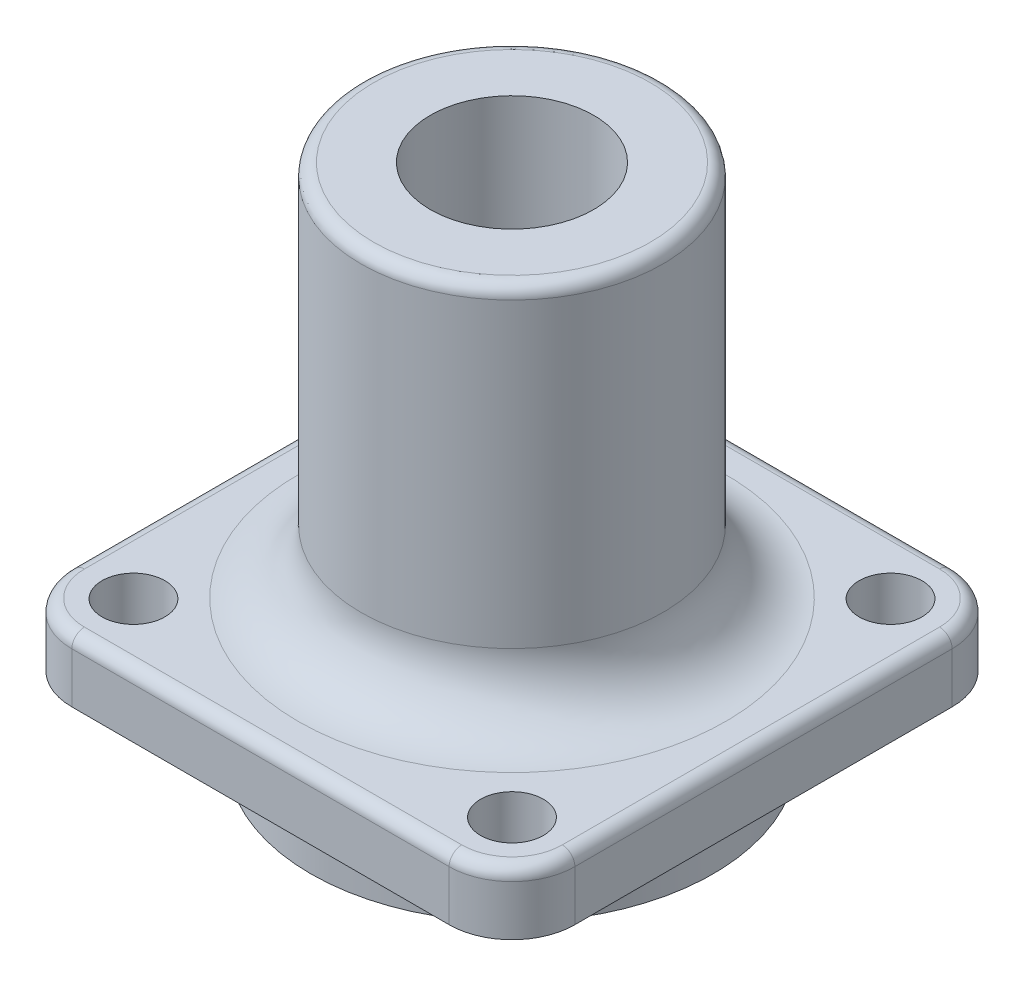
ISO-10303-21;
HEADER;
FILE_DESCRIPTION(('STEP AP214'),'2;1');
FILE_NAME('part.step','',(''),(''),'','','');
FILE_SCHEMA(('AUTOMOTIVE_DESIGN { 1 0 10303 214 1 1 1 1 }'));
ENDSEC;
DATA;
#1=APPLICATION_CONTEXT('core data for automotive mechanical design processes');
#2=APPLICATION_PROTOCOL_DEFINITION('international standard','automotive_design',2000,#1);
#3=PRODUCT_CONTEXT('',#1,'mechanical');
#4=PRODUCT('Part','Part','',(#3));
#5=PRODUCT_RELATED_PRODUCT_CATEGORY('part','',(#4));
#6=PRODUCT_DEFINITION_FORMATION('','',#4);
#7=PRODUCT_DEFINITION_CONTEXT('part definition',#1,'design');
#8=PRODUCT_DEFINITION('design','',#6,#7);
#9=PRODUCT_DEFINITION_SHAPE('','',#8);
#10=(LENGTH_UNIT() NAMED_UNIT(*) SI_UNIT(.MILLI.,.METRE.));
#11=(NAMED_UNIT(*) PLANE_ANGLE_UNIT() SI_UNIT($,.RADIAN.));
#12=(NAMED_UNIT(*) SI_UNIT($,.STERADIAN.) SOLID_ANGLE_UNIT());
#13=UNCERTAINTY_MEASURE_WITH_UNIT(LENGTH_MEASURE(1.E-05),#10,'distance_accuracy_value','');
#14=(GEOMETRIC_REPRESENTATION_CONTEXT(3) GLOBAL_UNCERTAINTY_ASSIGNED_CONTEXT((#13)) GLOBAL_UNIT_ASSIGNED_CONTEXT((#10,
#11,#12)) REPRESENTATION_CONTEXT('',''));
#15=CARTESIAN_POINT('',(0.,0.,0.));
#16=DIRECTION('',(0.,0.,1.));
#17=DIRECTION('',(1.,0.,0.));
#18=AXIS2_PLACEMENT_3D('',#15,#16,#17);
#19=CARTESIAN_POINT('',(0.,5.,0.));
#20=DIRECTION('',(0.,1.,0.));
#21=DIRECTION('',(0.,0.,1.));
#22=AXIS2_PLACEMENT_3D('',#19,#20,#21);
#23=PLANE('',#22);
#24=CARTESIAN_POINT('',(0.,5.,0.));
#25=DIRECTION('',(0.,1.,0.));
#26=DIRECTION('',(0.,0.,1.));
#27=AXIS2_PLACEMENT_3D('',#24,#25,#26);
#28=CIRCLE('',#27,17.);
#29=CARTESIAN_POINT('',(0.,5.,17.));
#30=VERTEX_POINT('',#29);
#31=EDGE_CURVE('E348',#30,#30,#28,.F.);
#32=ORIENTED_EDGE('',*,*,#31,.T.);
#33=EDGE_LOOP('',(#32));
#34=FACE_BOUND('',#33,.T.);
#35=CARTESIAN_POINT('',(-15.,5.,15.1028020210667));
#36=DIRECTION('',(0.,1.,0.));
#37=DIRECTION('',(0.,0.,1.));
#38=AXIS2_PLACEMENT_3D('',#35,#36,#37);
#39=CIRCLE('',#38,2.5);
#40=CARTESIAN_POINT('',(-15.,5.,17.6028020210667));
#41=VERTEX_POINT('',#40);
#42=EDGE_CURVE('E417',#41,#41,#39,.T.);
#43=ORIENTED_EDGE('',*,*,#42,.F.);
#44=EDGE_LOOP('',(#43));
#45=FACE_BOUND('',#44,.T.);
#46=CARTESIAN_POINT('',(15.1028020210667,5.,15.1028020210667));
#47=DIRECTION('',(0.,1.,0.));
#48=DIRECTION('',(0.,0.,1.));
#49=AXIS2_PLACEMENT_3D('',#46,#47,#48);
#50=CIRCLE('',#49,2.5);
#51=CARTESIAN_POINT('',(15.1028020210667,5.,17.6028020210667));
#52=VERTEX_POINT('',#51);
#53=EDGE_CURVE('E423',#52,#52,#50,.T.);
#54=ORIENTED_EDGE('',*,*,#53,.F.);
#55=EDGE_LOOP('',(#54));
#56=FACE_BOUND('',#55,.T.);
#57=CARTESIAN_POINT('',(15.1028020210667,5.,-15.));
#58=DIRECTION('',(0.,1.,0.));
#59=DIRECTION('',(0.,0.,1.));
#60=AXIS2_PLACEMENT_3D('',#57,#58,#59);
#61=CIRCLE('',#60,2.5);
#62=CARTESIAN_POINT('',(15.1028020210667,5.,-12.5));
#63=VERTEX_POINT('',#62);
#64=EDGE_CURVE('E460',#63,#63,#61,.T.);
#65=ORIENTED_EDGE('',*,*,#64,.F.);
#66=EDGE_LOOP('',(#65));
#67=FACE_BOUND('',#66,.T.);
#68=CARTESIAN_POINT('',(-15.,5.,-15.));
#69=DIRECTION('',(0.,1.,0.));
#70=DIRECTION('',(0.,0.,1.));
#71=AXIS2_PLACEMENT_3D('',#68,#69,#70);
#72=CIRCLE('',#71,2.5);
#73=CARTESIAN_POINT('',(-15.,5.,-12.5));
#74=VERTEX_POINT('',#73);
#75=EDGE_CURVE('E159',#74,#74,#72,.T.);
#76=ORIENTED_EDGE('',*,*,#75,.F.);
#77=EDGE_LOOP('',(#76));
#78=FACE_BOUND('',#77,.T.);
#79=CARTESIAN_POINT('',(15.,5.,-15.));
#80=DIRECTION('',(0.,1.,0.));
#81=DIRECTION('',(0.,0.,1.));
#82=AXIS2_PLACEMENT_3D('',#79,#80,#81);
#83=CIRCLE('',#82,4.);
#84=CARTESIAN_POINT('',(15.,5.,-19.));
#85=VERTEX_POINT('',#84);
#86=CARTESIAN_POINT('',(19.,5.,-15.));
#87=VERTEX_POINT('',#86);
#88=EDGE_CURVE('E147',#85,#87,#83,.F.);
#89=ORIENTED_EDGE('',*,*,#88,.F.);
#90=DIRECTION('',(1.,0.,0.));
#91=VECTOR('',#90,1.);
#92=CARTESIAN_POINT('',(0.,5.,-19.));
#93=LINE('',#92,#91);
#94=CARTESIAN_POINT('',(-15.,5.,-19.));
#95=VERTEX_POINT('',#94);
#96=EDGE_CURVE('E141',#85,#95,#93,.F.);
#97=ORIENTED_EDGE('',*,*,#96,.T.);
#98=CARTESIAN_POINT('',(-15.,5.,-15.));
#99=DIRECTION('',(0.,1.,0.));
#100=DIRECTION('',(0.,0.,1.));
#101=AXIS2_PLACEMENT_3D('',#98,#99,#100);
#102=CIRCLE('',#101,4.);
#103=CARTESIAN_POINT('',(-19.,5.,-15.));
#104=VERTEX_POINT('',#103);
#105=EDGE_CURVE('E136',#104,#95,#102,.F.);
#106=ORIENTED_EDGE('',*,*,#105,.F.);
#107=DIRECTION('',(0.,0.,1.));
#108=VECTOR('',#107,1.);
#109=CARTESIAN_POINT('',(-19.,5.,20.));
#110=LINE('',#109,#108);
#111=CARTESIAN_POINT('',(-19.,5.,15.));
#112=VERTEX_POINT('',#111);
#113=EDGE_CURVE('E139',#104,#112,#110,.T.);
#114=ORIENTED_EDGE('',*,*,#113,.T.);
#115=CARTESIAN_POINT('',(-15.,5.,15.));
#116=DIRECTION('',(0.,1.,0.));
#117=DIRECTION('',(0.,0.,1.));
#118=AXIS2_PLACEMENT_3D('',#115,#116,#117);
#119=CIRCLE('',#118,4.);
#120=CARTESIAN_POINT('',(-15.,5.,19.));
#121=VERTEX_POINT('',#120);
#122=EDGE_CURVE('E351',#121,#112,#119,.F.);
#123=ORIENTED_EDGE('',*,*,#122,.F.);
#124=DIRECTION('',(1.,0.,0.));
#125=VECTOR('',#124,1.);
#126=CARTESIAN_POINT('',(20.,5.,19.));
#127=LINE('',#126,#125);
#128=CARTESIAN_POINT('',(15.,5.,19.));
#129=VERTEX_POINT('',#128);
#130=EDGE_CURVE('E386',#121,#129,#127,.T.);
#131=ORIENTED_EDGE('',*,*,#130,.T.);
#132=CARTESIAN_POINT('',(15.,5.,15.));
#133=DIRECTION('',(0.,1.,0.));
#134=DIRECTION('',(0.,0.,1.));
#135=AXIS2_PLACEMENT_3D('',#132,#133,#134);
#136=CIRCLE('',#135,4.);
#137=CARTESIAN_POINT('',(19.,5.,15.));
#138=VERTEX_POINT('',#137);
#139=EDGE_CURVE('E148',#138,#129,#136,.F.);
#140=ORIENTED_EDGE('',*,*,#139,.F.);
#141=DIRECTION('',(0.,0.,1.));
#142=VECTOR('',#141,1.);
#143=CARTESIAN_POINT('',(19.,5.,0.));
#144=LINE('',#143,#142);
#145=EDGE_CURVE('E401',#138,#87,#144,.F.);
#146=ORIENTED_EDGE('',*,*,#145,.T.);
#147=EDGE_LOOP('',(#89,#97,#106,#114,#123,#131,#140,#146));
#148=FACE_BOUND('',#147,.T.);
#149=ADVANCED_FACE('F43',(#34,#45,#56,#67,#78,#148),#23,.T.);
#150=CARTESIAN_POINT('',(20.,5.,0.));
#151=DIRECTION('',(1.,0.,0.));
#152=DIRECTION('',(0.,0.,-1.));
#153=AXIS2_PLACEMENT_3D('',#150,#151,#152);
#154=PLANE('',#153);
#155=DIRECTION('',(0.,0.,1.));
#156=VECTOR('',#155,1.);
#157=CARTESIAN_POINT('',(20.,4.,0.));
#158=LINE('',#157,#156);
#159=CARTESIAN_POINT('',(20.,4.,-15.));
#160=VERTEX_POINT('',#159);
#161=CARTESIAN_POINT('',(20.,4.,15.));
#162=VERTEX_POINT('',#161);
#163=EDGE_CURVE('E392',#160,#162,#158,.T.);
#164=ORIENTED_EDGE('',*,*,#163,.T.);
#165=DIRECTION('',(0.,-1.,0.));
#166=VECTOR('',#165,1.);
#167=CARTESIAN_POINT('',(20.,0.,15.));
#168=LINE('',#167,#166);
#169=CARTESIAN_POINT('',(20.,0.,15.));
#170=VERTEX_POINT('',#169);
#171=EDGE_CURVE('E201',#162,#170,#168,.T.);
#172=ORIENTED_EDGE('',*,*,#171,.T.);
#173=DIRECTION('',(0.,0.,1.));
#174=VECTOR('',#173,1.);
#175=CARTESIAN_POINT('',(20.,0.,0.));
#176=LINE('',#175,#174);
#177=CARTESIAN_POINT('',(20.,0.,-15.));
#178=VERTEX_POINT('',#177);
#179=EDGE_CURVE('E415',#178,#170,#176,.T.);
#180=ORIENTED_EDGE('',*,*,#179,.F.);
#181=DIRECTION('',(0.,-1.,0.));
#182=VECTOR('',#181,1.);
#183=CARTESIAN_POINT('',(20.,5.,-15.));
#184=LINE('',#183,#182);
#185=EDGE_CURVE('E198',#178,#160,#184,.F.);
#186=ORIENTED_EDGE('',*,*,#185,.T.);
#187=EDGE_LOOP('',(#164,#172,#180,#186));
#188=FACE_BOUND('',#187,.T.);
#189=ADVANCED_FACE('F262',(#188),#154,.T.);
#190=CARTESIAN_POINT('',(0.,5.,-20.));
#191=DIRECTION('',(0.,0.,-1.));
#192=DIRECTION('',(-1.,0.,0.));
#193=AXIS2_PLACEMENT_3D('',#190,#191,#192);
#194=PLANE('',#193);
#195=DIRECTION('',(1.,0.,0.));
#196=VECTOR('',#195,1.);
#197=CARTESIAN_POINT('',(0.,0.,-20.));
#198=LINE('',#197,#196);
#199=CARTESIAN_POINT('',(-15.,0.,-20.));
#200=VERTEX_POINT('',#199);
#201=CARTESIAN_POINT('',(15.,0.,-20.));
#202=VERTEX_POINT('',#201);
#203=EDGE_CURVE('E426',#200,#202,#198,.T.);
#204=ORIENTED_EDGE('',*,*,#203,.F.);
#205=DIRECTION('',(0.,-1.,0.));
#206=VECTOR('',#205,1.);
#207=CARTESIAN_POINT('',(-15.,4.,-20.));
#208=LINE('',#207,#206);
#209=CARTESIAN_POINT('',(-15.,4.,-20.));
#210=VERTEX_POINT('',#209);
#211=EDGE_CURVE('E206',#200,#210,#208,.F.);
#212=ORIENTED_EDGE('',*,*,#211,.T.);
#213=DIRECTION('',(1.,0.,0.));
#214=VECTOR('',#213,1.);
#215=CARTESIAN_POINT('',(0.,4.,-20.));
#216=LINE('',#215,#214);
#217=CARTESIAN_POINT('',(15.,4.,-20.));
#218=VERTEX_POINT('',#217);
#219=EDGE_CURVE('E357',#210,#218,#216,.T.);
#220=ORIENTED_EDGE('',*,*,#219,.T.);
#221=DIRECTION('',(0.,-1.,0.));
#222=VECTOR('',#221,1.);
#223=CARTESIAN_POINT('',(15.,5.,-20.));
#224=LINE('',#223,#222);
#225=EDGE_CURVE('E60',#218,#202,#224,.T.);
#226=ORIENTED_EDGE('',*,*,#225,.T.);
#227=EDGE_LOOP('',(#204,#212,#220,#226));
#228=FACE_BOUND('',#227,.T.);
#229=ADVANCED_FACE('F268',(#228),#194,.T.);
#230=CARTESIAN_POINT('',(-20.,5.,0.));
#231=DIRECTION('',(1.,0.,0.));
#232=DIRECTION('',(0.,0.,-1.));
#233=AXIS2_PLACEMENT_3D('',#230,#231,#232);
#234=PLANE('',#233);
#235=DIRECTION('',(0.,0.,1.));
#236=VECTOR('',#235,1.);
#237=CARTESIAN_POINT('',(-20.,0.,0.));
#238=LINE('',#237,#236);
#239=CARTESIAN_POINT('',(-20.,0.,-15.));
#240=VERTEX_POINT('',#239);
#241=CARTESIAN_POINT('',(-20.,0.,15.));
#242=VERTEX_POINT('',#241);
#243=EDGE_CURVE('E418',#240,#242,#238,.T.);
#244=ORIENTED_EDGE('',*,*,#243,.T.);
#245=DIRECTION('',(0.,-1.,0.));
#246=VECTOR('',#245,1.);
#247=CARTESIAN_POINT('',(-20.,5.,15.));
#248=LINE('',#247,#246);
#249=CARTESIAN_POINT('',(-20.,4.,15.));
#250=VERTEX_POINT('',#249);
#251=EDGE_CURVE('E195',#242,#250,#248,.F.);
#252=ORIENTED_EDGE('',*,*,#251,.T.);
#253=DIRECTION('',(0.,0.,1.));
#254=VECTOR('',#253,1.);
#255=CARTESIAN_POINT('',(-20.,4.,-20.));
#256=LINE('',#255,#254);
#257=CARTESIAN_POINT('',(-20.,4.,-15.));
#258=VERTEX_POINT('',#257);
#259=EDGE_CURVE('E352',#250,#258,#256,.F.);
#260=ORIENTED_EDGE('',*,*,#259,.T.);
#261=DIRECTION('',(0.,-1.,0.));
#262=VECTOR('',#261,1.);
#263=CARTESIAN_POINT('',(-20.,0.,-15.));
#264=LINE('',#263,#262);
#265=EDGE_CURVE('E192',#258,#240,#264,.T.);
#266=ORIENTED_EDGE('',*,*,#265,.T.);
#267=EDGE_LOOP('',(#244,#252,#260,#266));
#268=FACE_BOUND('',#267,.T.);
#269=ADVANCED_FACE('F282',(#268),#234,.F.);
#270=CARTESIAN_POINT('',(-15.,5.,-15.));
#271=DIRECTION('',(0.,-1.,0.));
#272=DIRECTION('',(0.,0.,-1.));
#273=AXIS2_PLACEMENT_3D('',#270,#271,#272);
#274=CYLINDRICAL_SURFACE('',#273,2.5);
#275=ORIENTED_EDGE('',*,*,#75,.T.);
#276=EDGE_LOOP('',(#275));
#277=FACE_BOUND('',#276,.T.);
#278=CARTESIAN_POINT('',(-15.,0.,-15.));
#279=DIRECTION('',(0.,1.,0.));
#280=DIRECTION('',(0.,0.,1.));
#281=AXIS2_PLACEMENT_3D('',#278,#279,#280);
#282=CIRCLE('',#281,2.5);
#283=CARTESIAN_POINT('',(-15.,0.,-12.5));
#284=VERTEX_POINT('',#283);
#285=EDGE_CURVE('E439',#284,#284,#282,.T.);
#286=ORIENTED_EDGE('',*,*,#285,.F.);
#287=EDGE_LOOP('',(#286));
#288=FACE_BOUND('',#287,.T.);
#289=ADVANCED_FACE('F285',(#277,#288),#274,.F.);
#290=CARTESIAN_POINT('',(15.1028020210667,5.,-15.));
#291=DIRECTION('',(0.,-1.,0.));
#292=DIRECTION('',(0.,0.,-1.));
#293=AXIS2_PLACEMENT_3D('',#290,#291,#292);
#294=CYLINDRICAL_SURFACE('',#293,2.5);
#295=ORIENTED_EDGE('',*,*,#64,.T.);
#296=EDGE_LOOP('',(#295));
#297=FACE_BOUND('',#296,.T.);
#298=CARTESIAN_POINT('',(15.1028020210667,0.,-15.));
#299=DIRECTION('',(0.,1.,0.));
#300=DIRECTION('',(0.,0.,1.));
#301=AXIS2_PLACEMENT_3D('',#298,#299,#300);
#302=CIRCLE('',#301,2.5);
#303=CARTESIAN_POINT('',(15.1028020210667,0.,-12.5));
#304=VERTEX_POINT('',#303);
#305=EDGE_CURVE('E444',#304,#304,#302,.T.);
#306=ORIENTED_EDGE('',*,*,#305,.F.);
#307=EDGE_LOOP('',(#306));
#308=FACE_BOUND('',#307,.T.);
#309=ADVANCED_FACE('F291',(#297,#308),#294,.F.);
#310=CARTESIAN_POINT('',(15.1028020210667,5.,15.1028020210667));
#311=DIRECTION('',(0.,-1.,0.));
#312=DIRECTION('',(0.,0.,-1.));
#313=AXIS2_PLACEMENT_3D('',#310,#311,#312);
#314=CYLINDRICAL_SURFACE('',#313,2.5);
#315=ORIENTED_EDGE('',*,*,#53,.T.);
#316=EDGE_LOOP('',(#315));
#317=FACE_BOUND('',#316,.T.);
#318=CARTESIAN_POINT('',(15.1028020210667,0.,15.1028020210667));
#319=DIRECTION('',(0.,1.,0.));
#320=DIRECTION('',(0.,0.,1.));
#321=AXIS2_PLACEMENT_3D('',#318,#319,#320);
#322=CIRCLE('',#321,2.5);
#323=CARTESIAN_POINT('',(15.1028020210667,0.,17.6028020210667));
#324=VERTEX_POINT('',#323);
#325=EDGE_CURVE('E450',#324,#324,#322,.T.);
#326=ORIENTED_EDGE('',*,*,#325,.F.);
#327=EDGE_LOOP('',(#326));
#328=FACE_BOUND('',#327,.T.);
#329=ADVANCED_FACE('F295',(#317,#328),#314,.F.);
#330=CARTESIAN_POINT('',(-15.,5.,15.1028020210667));
#331=DIRECTION('',(0.,-1.,0.));
#332=DIRECTION('',(0.,0.,-1.));
#333=AXIS2_PLACEMENT_3D('',#330,#331,#332);
#334=CYLINDRICAL_SURFACE('',#333,2.5);
#335=ORIENTED_EDGE('',*,*,#42,.T.);
#336=EDGE_LOOP('',(#335));
#337=FACE_BOUND('',#336,.T.);
#338=CARTESIAN_POINT('',(-15.,0.,15.1028020210667));
#339=DIRECTION('',(0.,1.,0.));
#340=DIRECTION('',(0.,0.,1.));
#341=AXIS2_PLACEMENT_3D('',#338,#339,#340);
#342=CIRCLE('',#341,2.5);
#343=CARTESIAN_POINT('',(-15.,0.,17.6028020210667));
#344=VERTEX_POINT('',#343);
#345=EDGE_CURVE('E218',#344,#344,#342,.T.);
#346=ORIENTED_EDGE('',*,*,#345,.F.);
#347=EDGE_LOOP('',(#346));
#348=FACE_BOUND('',#347,.T.);
#349=ADVANCED_FACE('F280',(#337,#348),#334,.F.);
#350=CARTESIAN_POINT('',(0.,5.,20.));
#351=DIRECTION('',(0.,0.,-1.));
#352=DIRECTION('',(-1.,0.,0.));
#353=AXIS2_PLACEMENT_3D('',#350,#351,#352);
#354=PLANE('',#353);
#355=DIRECTION('',(1.,0.,0.));
#356=VECTOR('',#355,1.);
#357=CARTESIAN_POINT('',(-20.,4.,20.));
#358=LINE('',#357,#356);
#359=CARTESIAN_POINT('',(15.,4.,20.));
#360=VERTEX_POINT('',#359);
#361=CARTESIAN_POINT('',(-15.,4.,20.));
#362=VERTEX_POINT('',#361);
#363=EDGE_CURVE('E383',#360,#362,#358,.F.);
#364=ORIENTED_EDGE('',*,*,#363,.T.);
#365=DIRECTION('',(0.,-1.,0.));
#366=VECTOR('',#365,1.);
#367=CARTESIAN_POINT('',(-15.,5.,20.));
#368=LINE('',#367,#366);
#369=CARTESIAN_POINT('',(-15.,0.,20.));
#370=VERTEX_POINT('',#369);
#371=EDGE_CURVE('E178',#362,#370,#368,.T.);
#372=ORIENTED_EDGE('',*,*,#371,.T.);
#373=DIRECTION('',(1.,0.,0.));
#374=VECTOR('',#373,1.);
#375=CARTESIAN_POINT('',(0.,0.,20.));
#376=LINE('',#375,#374);
#377=CARTESIAN_POINT('',(15.,0.,20.));
#378=VERTEX_POINT('',#377);
#379=EDGE_CURVE('E414',#370,#378,#376,.T.);
#380=ORIENTED_EDGE('',*,*,#379,.T.);
#381=DIRECTION('',(0.,-1.,0.));
#382=VECTOR('',#381,1.);
#383=CARTESIAN_POINT('',(15.,4.,20.));
#384=LINE('',#383,#382);
#385=EDGE_CURVE('E170',#378,#360,#384,.F.);
#386=ORIENTED_EDGE('',*,*,#385,.T.);
#387=EDGE_LOOP('',(#364,#372,#380,#386));
#388=FACE_BOUND('',#387,.T.);
#389=ADVANCED_FACE('F276',(#388),#354,.F.);
#390=CARTESIAN_POINT('',(0.,0.,0.));
#391=DIRECTION('',(0.,1.,0.));
#392=DIRECTION('',(0.,0.,1.));
#393=AXIS2_PLACEMENT_3D('',#390,#391,#392);
#394=PLANE('',#393);
#395=CARTESIAN_POINT('',(0.,0.,0.));
#396=DIRECTION('',(0.,1.,0.));
#397=DIRECTION('',(0.,0.,1.));
#398=AXIS2_PLACEMENT_3D('',#395,#396,#397);
#399=CIRCLE('',#398,16.);
#400=CARTESIAN_POINT('',(0.,0.,16.));
#401=VERTEX_POINT('',#400);
#402=EDGE_CURVE('E11',#401,#401,#399,.F.);
#403=ORIENTED_EDGE('',*,*,#402,.F.);
#404=EDGE_LOOP('',(#403));
#405=FACE_BOUND('',#404,.T.);
#406=ORIENTED_EDGE('',*,*,#345,.T.);
#407=EDGE_LOOP('',(#406));
#408=FACE_BOUND('',#407,.T.);
#409=ORIENTED_EDGE('',*,*,#325,.T.);
#410=EDGE_LOOP('',(#409));
#411=FACE_BOUND('',#410,.T.);
#412=ORIENTED_EDGE('',*,*,#305,.T.);
#413=EDGE_LOOP('',(#412));
#414=FACE_BOUND('',#413,.T.);
#415=ORIENTED_EDGE('',*,*,#285,.T.);
#416=EDGE_LOOP('',(#415));
#417=FACE_BOUND('',#416,.T.);
#418=ORIENTED_EDGE('',*,*,#379,.F.);
#419=CARTESIAN_POINT('',(-15.,0.,15.));
#420=DIRECTION('',(0.,1.,0.));
#421=DIRECTION('',(0.,0.,1.));
#422=AXIS2_PLACEMENT_3D('',#419,#420,#421);
#423=CIRCLE('',#422,5.);
#424=EDGE_CURVE('E189',#370,#242,#423,.F.);
#425=ORIENTED_EDGE('',*,*,#424,.T.);
#426=ORIENTED_EDGE('',*,*,#243,.F.);
#427=CARTESIAN_POINT('',(-15.,0.,-15.));
#428=DIRECTION('',(0.,1.,0.));
#429=DIRECTION('',(0.,0.,1.));
#430=AXIS2_PLACEMENT_3D('',#427,#428,#429);
#431=CIRCLE('',#430,5.);
#432=EDGE_CURVE('E67',#240,#200,#431,.F.);
#433=ORIENTED_EDGE('',*,*,#432,.T.);
#434=ORIENTED_EDGE('',*,*,#203,.T.);
#435=CARTESIAN_POINT('',(15.,0.,-15.));
#436=DIRECTION('',(0.,1.,0.));
#437=DIRECTION('',(0.,0.,1.));
#438=AXIS2_PLACEMENT_3D('',#435,#436,#437);
#439=CIRCLE('',#438,5.);
#440=EDGE_CURVE('E181',#202,#178,#439,.F.);
#441=ORIENTED_EDGE('',*,*,#440,.T.);
#442=ORIENTED_EDGE('',*,*,#179,.T.);
#443=CARTESIAN_POINT('',(15.,0.,15.));
#444=DIRECTION('',(0.,1.,0.));
#445=DIRECTION('',(0.,0.,1.));
#446=AXIS2_PLACEMENT_3D('',#443,#444,#445);
#447=CIRCLE('',#446,5.);
#448=EDGE_CURVE('E186',#170,#378,#447,.F.);
#449=ORIENTED_EDGE('',*,*,#448,.T.);
#450=EDGE_LOOP('',(#418,#425,#426,#433,#434,#441,#442,#449));
#451=FACE_BOUND('',#450,.T.);
#452=ADVANCED_FACE('F257',(#405,#408,#411,#414,#417,#451),#394,.F.);
#453=CARTESIAN_POINT('',(0.,35.,0.));
#454=DIRECTION('',(0.,-1.,0.));
#455=DIRECTION('',(0.,0.,-1.));
#456=AXIS2_PLACEMENT_3D('',#453,#454,#455);
#457=CYLINDRICAL_SURFACE('',#456,12.);
#458=CARTESIAN_POINT('',(0.,34.,0.));
#459=DIRECTION('',(0.,1.,0.));
#460=DIRECTION('',(0.,0.,1.));
#461=AXIS2_PLACEMENT_3D('',#458,#459,#460);
#462=CIRCLE('',#461,12.);
#463=CARTESIAN_POINT('',(0.,34.,12.));
#464=VERTEX_POINT('',#463);
#465=EDGE_CURVE('E53',#464,#464,#462,.F.);
#466=ORIENTED_EDGE('',*,*,#465,.T.);
#467=EDGE_LOOP('',(#466));
#468=FACE_BOUND('',#467,.T.);
#469=CARTESIAN_POINT('',(0.,10.,0.));
#470=DIRECTION('',(0.,1.,0.));
#471=DIRECTION('',(0.,0.,1.));
#472=AXIS2_PLACEMENT_3D('',#469,#470,#471);
#473=CIRCLE('',#472,12.);
#474=CARTESIAN_POINT('',(0.,10.,12.));
#475=VERTEX_POINT('',#474);
#476=EDGE_CURVE('E209',#475,#475,#473,.T.);
#477=ORIENTED_EDGE('',*,*,#476,.T.);
#478=EDGE_LOOP('',(#477));
#479=FACE_BOUND('',#478,.T.);
#480=ADVANCED_FACE('F237',(#468,#479),#457,.T.);
#481=CARTESIAN_POINT('',(0.,35.,0.));
#482=DIRECTION('',(0.,1.,0.));
#483=DIRECTION('',(0.,0.,1.));
#484=AXIS2_PLACEMENT_3D('',#481,#482,#483);
#485=PLANE('',#484);
#486=CARTESIAN_POINT('',(0.,35.,0.));
#487=DIRECTION('',(0.,1.,0.));
#488=DIRECTION('',(0.,0.,1.));
#489=AXIS2_PLACEMENT_3D('',#486,#487,#488);
#490=CIRCLE('',#489,6.5);
#491=CARTESIAN_POINT('',(0.,35.,6.5));
#492=VERTEX_POINT('',#491);
#493=EDGE_CURVE('E470',#492,#492,#490,.T.);
#494=ORIENTED_EDGE('',*,*,#493,.F.);
#495=EDGE_LOOP('',(#494));
#496=FACE_BOUND('',#495,.T.);
#497=CARTESIAN_POINT('',(0.,35.,0.));
#498=DIRECTION('',(0.,1.,0.));
#499=DIRECTION('',(0.,0.,1.));
#500=AXIS2_PLACEMENT_3D('',#497,#498,#499);
#501=CIRCLE('',#500,11.);
#502=CARTESIAN_POINT('',(0.,35.,11.));
#503=VERTEX_POINT('',#502);
#504=EDGE_CURVE('E213',#503,#503,#501,.T.);
#505=ORIENTED_EDGE('',*,*,#504,.T.);
#506=EDGE_LOOP('',(#505));
#507=FACE_BOUND('',#506,.T.);
#508=ADVANCED_FACE('F246',(#496,#507),#485,.T.);
#509=CARTESIAN_POINT('',(0.,4.,-19.));
#510=DIRECTION('',(1.,0.,0.));
#511=DIRECTION('',(0.,0.,-1.));
#512=AXIS2_PLACEMENT_3D('',#509,#510,#511);
#513=CYLINDRICAL_SURFACE('',#512,1.);
#514=ORIENTED_EDGE('',*,*,#219,.F.);
#515=CARTESIAN_POINT('',(-15.,4.,-19.));
#516=DIRECTION('',(1.,0.,0.));
#517=DIRECTION('',(0.,0.,-1.));
#518=AXIS2_PLACEMENT_3D('',#515,#516,#517);
#519=CIRCLE('',#518,1.);
#520=EDGE_CURVE('E376',#210,#95,#519,.T.);
#521=ORIENTED_EDGE('',*,*,#520,.T.);
#522=ORIENTED_EDGE('',*,*,#96,.F.);
#523=CARTESIAN_POINT('',(15.,4.,-19.));
#524=DIRECTION('',(-1.,0.,0.));
#525=DIRECTION('',(0.,0.,1.));
#526=AXIS2_PLACEMENT_3D('',#523,#524,#525);
#527=CIRCLE('',#526,1.);
#528=EDGE_CURVE('E373',#85,#218,#527,.T.);
#529=ORIENTED_EDGE('',*,*,#528,.T.);
#530=EDGE_LOOP('',(#514,#521,#522,#529));
#531=FACE_BOUND('',#530,.T.);
#532=ADVANCED_FACE('F248',(#531),#513,.T.);
#533=CARTESIAN_POINT('',(-19.,4.,0.));
#534=DIRECTION('',(0.,0.,-1.));
#535=DIRECTION('',(-1.,0.,0.));
#536=AXIS2_PLACEMENT_3D('',#533,#534,#535);
#537=CYLINDRICAL_SURFACE('',#536,1.);
#538=ORIENTED_EDGE('',*,*,#259,.F.);
#539=CARTESIAN_POINT('',(-19.,4.,15.));
#540=DIRECTION('',(0.,0.,-1.));
#541=DIRECTION('',(-1.,0.,0.));
#542=AXIS2_PLACEMENT_3D('',#539,#540,#541);
#543=CIRCLE('',#542,1.);
#544=EDGE_CURVE('E157',#250,#112,#543,.T.);
#545=ORIENTED_EDGE('',*,*,#544,.T.);
#546=ORIENTED_EDGE('',*,*,#113,.F.);
#547=CARTESIAN_POINT('',(-19.,4.,-15.));
#548=DIRECTION('',(0.,0.,1.));
#549=DIRECTION('',(1.,0.,0.));
#550=AXIS2_PLACEMENT_3D('',#547,#548,#549);
#551=CIRCLE('',#550,1.);
#552=EDGE_CURVE('E154',#104,#258,#551,.T.);
#553=ORIENTED_EDGE('',*,*,#552,.T.);
#554=EDGE_LOOP('',(#538,#545,#546,#553));
#555=FACE_BOUND('',#554,.T.);
#556=ADVANCED_FACE('F153',(#555),#537,.T.);
#557=CARTESIAN_POINT('',(19.,4.,0.));
#558=DIRECTION('',(0.,0.,1.));
#559=DIRECTION('',(1.,0.,0.));
#560=AXIS2_PLACEMENT_3D('',#557,#558,#559);
#561=CYLINDRICAL_SURFACE('',#560,1.);
#562=ORIENTED_EDGE('',*,*,#163,.F.);
#563=CARTESIAN_POINT('',(19.,4.,-15.));
#564=DIRECTION('',(0.,0.,1.));
#565=DIRECTION('',(1.,0.,0.));
#566=AXIS2_PLACEMENT_3D('',#563,#564,#565);
#567=CIRCLE('',#566,1.);
#568=EDGE_CURVE('E370',#160,#87,#567,.T.);
#569=ORIENTED_EDGE('',*,*,#568,.T.);
#570=ORIENTED_EDGE('',*,*,#145,.F.);
#571=CARTESIAN_POINT('',(19.,4.,15.));
#572=DIRECTION('',(0.,0.,-1.));
#573=DIRECTION('',(-1.,0.,0.));
#574=AXIS2_PLACEMENT_3D('',#571,#572,#573);
#575=CIRCLE('',#574,1.);
#576=EDGE_CURVE('E367',#138,#162,#575,.T.);
#577=ORIENTED_EDGE('',*,*,#576,.T.);
#578=EDGE_LOOP('',(#562,#569,#570,#577));
#579=FACE_BOUND('',#578,.T.);
#580=ADVANCED_FACE('F307',(#579),#561,.T.);
#581=CARTESIAN_POINT('',(0.,4.,19.));
#582=DIRECTION('',(-1.,0.,0.));
#583=DIRECTION('',(0.,0.,1.));
#584=AXIS2_PLACEMENT_3D('',#581,#582,#583);
#585=CYLINDRICAL_SURFACE('',#584,1.);
#586=ORIENTED_EDGE('',*,*,#363,.F.);
#587=CARTESIAN_POINT('',(15.,4.,19.));
#588=DIRECTION('',(-1.,0.,0.));
#589=DIRECTION('',(0.,0.,1.));
#590=AXIS2_PLACEMENT_3D('',#587,#588,#589);
#591=CIRCLE('',#590,1.);
#592=EDGE_CURVE('E166',#360,#129,#591,.T.);
#593=ORIENTED_EDGE('',*,*,#592,.T.);
#594=ORIENTED_EDGE('',*,*,#130,.F.);
#595=CARTESIAN_POINT('',(-15.,4.,19.));
#596=DIRECTION('',(1.,0.,0.));
#597=DIRECTION('',(0.,0.,-1.));
#598=AXIS2_PLACEMENT_3D('',#595,#596,#597);
#599=CIRCLE('',#598,1.);
#600=EDGE_CURVE('E172',#121,#362,#599,.T.);
#601=ORIENTED_EDGE('',*,*,#600,.T.);
#602=EDGE_LOOP('',(#586,#593,#594,#601));
#603=FACE_BOUND('',#602,.T.);
#604=ADVANCED_FACE('F303',(#603),#585,.T.);
#605=CARTESIAN_POINT('',(15.,5.,-15.));
#606=DIRECTION('',(0.,-1.,0.));
#607=DIRECTION('',(0.,0.,-1.));
#608=AXIS2_PLACEMENT_3D('',#605,#606,#607);
#609=CYLINDRICAL_SURFACE('',#608,5.);
#610=ORIENTED_EDGE('',*,*,#440,.F.);
#611=ORIENTED_EDGE('',*,*,#225,.F.);
#612=CARTESIAN_POINT('',(15.,4.,-15.));
#613=DIRECTION('',(0.,1.,0.));
#614=DIRECTION('',(0.,0.,1.));
#615=AXIS2_PLACEMENT_3D('',#612,#613,#614);
#616=CIRCLE('',#615,5.);
#617=EDGE_CURVE('E214',#160,#218,#616,.T.);
#618=ORIENTED_EDGE('',*,*,#617,.F.);
#619=ORIENTED_EDGE('',*,*,#185,.F.);
#620=EDGE_LOOP('',(#610,#611,#618,#619));
#621=FACE_BOUND('',#620,.T.);
#622=ADVANCED_FACE('F306',(#621),#609,.T.);
#623=CARTESIAN_POINT('',(15.,4.,-15.));
#624=DIRECTION('',(0.,1.,0.));
#625=DIRECTION('',(0.,0.,1.));
#626=AXIS2_PLACEMENT_3D('',#623,#624,#625);
#627=TOROIDAL_SURFACE('',#626,4.,1.);
#628=ORIENTED_EDGE('',*,*,#528,.F.);
#629=ORIENTED_EDGE('',*,*,#88,.T.);
#630=ORIENTED_EDGE('',*,*,#568,.F.);
#631=ORIENTED_EDGE('',*,*,#617,.T.);
#632=EDGE_LOOP('',(#628,#629,#630,#631));
#633=FACE_BOUND('',#632,.T.);
#634=ADVANCED_FACE('F314',(#633),#627,.T.);
#635=CARTESIAN_POINT('',(-15.,5.,-15.));
#636=DIRECTION('',(0.,1.,0.));
#637=DIRECTION('',(0.,0.,1.));
#638=AXIS2_PLACEMENT_3D('',#635,#636,#637);
#639=CYLINDRICAL_SURFACE('',#638,5.);
#640=ORIENTED_EDGE('',*,*,#432,.F.);
#641=ORIENTED_EDGE('',*,*,#265,.F.);
#642=CARTESIAN_POINT('',(-15.,4.,-15.));
#643=DIRECTION('',(0.,1.,0.));
#644=DIRECTION('',(0.,0.,1.));
#645=AXIS2_PLACEMENT_3D('',#642,#643,#644);
#646=CIRCLE('',#645,5.);
#647=EDGE_CURVE('E164',#210,#258,#646,.T.);
#648=ORIENTED_EDGE('',*,*,#647,.F.);
#649=ORIENTED_EDGE('',*,*,#211,.F.);
#650=EDGE_LOOP('',(#640,#641,#648,#649));
#651=FACE_BOUND('',#650,.T.);
#652=ADVANCED_FACE('F317',(#651),#639,.T.);
#653=CARTESIAN_POINT('',(-15.,4.,-15.));
#654=DIRECTION('',(0.,1.,0.));
#655=DIRECTION('',(0.,0.,1.));
#656=AXIS2_PLACEMENT_3D('',#653,#654,#655);
#657=TOROIDAL_SURFACE('',#656,4.,1.);
#658=ORIENTED_EDGE('',*,*,#520,.F.);
#659=ORIENTED_EDGE('',*,*,#647,.T.);
#660=ORIENTED_EDGE('',*,*,#552,.F.);
#661=ORIENTED_EDGE('',*,*,#105,.T.);
#662=EDGE_LOOP('',(#658,#659,#660,#661));
#663=FACE_BOUND('',#662,.T.);
#664=ADVANCED_FACE('F162',(#663),#657,.T.);
#665=CARTESIAN_POINT('',(15.,5.,15.));
#666=DIRECTION('',(0.,1.,0.));
#667=DIRECTION('',(0.,0.,1.));
#668=AXIS2_PLACEMENT_3D('',#665,#666,#667);
#669=CYLINDRICAL_SURFACE('',#668,5.);
#670=ORIENTED_EDGE('',*,*,#448,.F.);
#671=ORIENTED_EDGE('',*,*,#171,.F.);
#672=CARTESIAN_POINT('',(15.,4.,15.));
#673=DIRECTION('',(0.,1.,0.));
#674=DIRECTION('',(0.,0.,1.));
#675=AXIS2_PLACEMENT_3D('',#672,#673,#674);
#676=CIRCLE('',#675,5.);
#677=EDGE_CURVE('E221',#360,#162,#676,.T.);
#678=ORIENTED_EDGE('',*,*,#677,.F.);
#679=ORIENTED_EDGE('',*,*,#385,.F.);
#680=EDGE_LOOP('',(#670,#671,#678,#679));
#681=FACE_BOUND('',#680,.T.);
#682=ADVANCED_FACE('F324',(#681),#669,.T.);
#683=CARTESIAN_POINT('',(15.,4.,15.));
#684=DIRECTION('',(0.,1.,0.));
#685=DIRECTION('',(0.,0.,1.));
#686=AXIS2_PLACEMENT_3D('',#683,#684,#685);
#687=TOROIDAL_SURFACE('',#686,4.,1.);
#688=ORIENTED_EDGE('',*,*,#576,.F.);
#689=ORIENTED_EDGE('',*,*,#139,.T.);
#690=ORIENTED_EDGE('',*,*,#592,.F.);
#691=ORIENTED_EDGE('',*,*,#677,.T.);
#692=EDGE_LOOP('',(#688,#689,#690,#691));
#693=FACE_BOUND('',#692,.T.);
#694=ADVANCED_FACE('F328',(#693),#687,.T.);
#695=CARTESIAN_POINT('',(-15.,5.,15.));
#696=DIRECTION('',(0.,-1.,0.));
#697=DIRECTION('',(0.,0.,-1.));
#698=AXIS2_PLACEMENT_3D('',#695,#696,#697);
#699=CYLINDRICAL_SURFACE('',#698,5.);
#700=ORIENTED_EDGE('',*,*,#424,.F.);
#701=ORIENTED_EDGE('',*,*,#371,.F.);
#702=CARTESIAN_POINT('',(-15.,4.,15.));
#703=DIRECTION('',(0.,1.,0.));
#704=DIRECTION('',(0.,0.,1.));
#705=AXIS2_PLACEMENT_3D('',#702,#703,#704);
#706=CIRCLE('',#705,5.);
#707=EDGE_CURVE('E225',#250,#362,#706,.T.);
#708=ORIENTED_EDGE('',*,*,#707,.F.);
#709=ORIENTED_EDGE('',*,*,#251,.F.);
#710=EDGE_LOOP('',(#700,#701,#708,#709));
#711=FACE_BOUND('',#710,.T.);
#712=ADVANCED_FACE('F331',(#711),#699,.T.);
#713=CARTESIAN_POINT('',(-15.,4.,15.));
#714=DIRECTION('',(0.,1.,0.));
#715=DIRECTION('',(0.,0.,1.));
#716=AXIS2_PLACEMENT_3D('',#713,#714,#715);
#717=TOROIDAL_SURFACE('',#716,4.,1.);
#718=ORIENTED_EDGE('',*,*,#544,.F.);
#719=ORIENTED_EDGE('',*,*,#707,.T.);
#720=ORIENTED_EDGE('',*,*,#600,.F.);
#721=ORIENTED_EDGE('',*,*,#122,.T.);
#722=EDGE_LOOP('',(#718,#719,#720,#721));
#723=FACE_BOUND('',#722,.T.);
#724=ADVANCED_FACE('F336',(#723),#717,.T.);
#725=CARTESIAN_POINT('',(0.,10.,0.));
#726=DIRECTION('',(0.,1.,0.));
#727=DIRECTION('',(0.,0.,1.));
#728=AXIS2_PLACEMENT_3D('',#725,#726,#727);
#729=TOROIDAL_SURFACE('',#728,17.,5.);
#730=ORIENTED_EDGE('',*,*,#31,.F.);
#731=EDGE_LOOP('',(#730));
#732=FACE_BOUND('',#731,.T.);
#733=ORIENTED_EDGE('',*,*,#476,.F.);
#734=EDGE_LOOP('',(#733));
#735=FACE_BOUND('',#734,.T.);
#736=ADVANCED_FACE('F243',(#732,#735),#729,.F.);
#737=CARTESIAN_POINT('',(0.,34.,0.));
#738=DIRECTION('',(0.,1.,0.));
#739=DIRECTION('',(0.,0.,1.));
#740=AXIS2_PLACEMENT_3D('',#737,#738,#739);
#741=TOROIDAL_SURFACE('',#740,11.,1.);
#742=ORIENTED_EDGE('',*,*,#465,.F.);
#743=EDGE_LOOP('',(#742));
#744=FACE_BOUND('',#743,.T.);
#745=ORIENTED_EDGE('',*,*,#504,.F.);
#746=EDGE_LOOP('',(#745));
#747=FACE_BOUND('',#746,.T.);
#748=ADVANCED_FACE('F45',(#744,#747),#741,.T.);
#749=CARTESIAN_POINT('',(0.,-6.,0.));
#750=DIRECTION('',(0.,1.,0.));
#751=DIRECTION('',(0.,0.,1.));
#752=AXIS2_PLACEMENT_3D('',#749,#750,#751);
#753=CYLINDRICAL_SURFACE('',#752,16.);
#754=CARTESIAN_POINT('',(0.,-6.,0.));
#755=DIRECTION('',(0.,-1.,0.));
#756=DIRECTION('',(0.,0.,-1.));
#757=AXIS2_PLACEMENT_3D('',#754,#755,#756);
#758=CIRCLE('',#757,16.);
#759=CARTESIAN_POINT('',(0.,-6.,-16.));
#760=VERTEX_POINT('',#759);
#761=EDGE_CURVE('E229',#760,#760,#758,.T.);
#762=ORIENTED_EDGE('',*,*,#761,.F.);
#763=EDGE_LOOP('',(#762));
#764=FACE_BOUND('',#763,.T.);
#765=ORIENTED_EDGE('',*,*,#402,.T.);
#766=EDGE_LOOP('',(#765));
#767=FACE_BOUND('',#766,.T.);
#768=ADVANCED_FACE('F242',(#764,#767),#753,.T.);
#769=CARTESIAN_POINT('',(0.,-6.,0.));
#770=DIRECTION('',(0.,-1.,0.));
#771=DIRECTION('',(0.,0.,-1.));
#772=AXIS2_PLACEMENT_3D('',#769,#770,#771);
#773=PLANE('',#772);
#774=CARTESIAN_POINT('',(0.,-6.,0.));
#775=DIRECTION('',(0.,-1.,0.));
#776=DIRECTION('',(0.,0.,-1.));
#777=AXIS2_PLACEMENT_3D('',#774,#775,#776);
#778=CIRCLE('',#777,6.5);
#779=CARTESIAN_POINT('',(0.,-6.,-6.5));
#780=VERTEX_POINT('',#779);
#781=EDGE_CURVE('E47',#780,#780,#778,.T.);
#782=ORIENTED_EDGE('',*,*,#781,.F.);
#783=EDGE_LOOP('',(#782));
#784=FACE_BOUND('',#783,.T.);
#785=ORIENTED_EDGE('',*,*,#761,.T.);
#786=EDGE_LOOP('',(#785));
#787=FACE_BOUND('',#786,.T.);
#788=ADVANCED_FACE('F480',(#784,#787),#773,.T.);
#789=CARTESIAN_POINT('',(0.,-20.,0.));
#790=DIRECTION('',(0.,1.,0.));
#791=DIRECTION('',(0.,0.,1.));
#792=AXIS2_PLACEMENT_3D('',#789,#790,#791);
#793=CYLINDRICAL_SURFACE('',#792,6.5);
#794=ORIENTED_EDGE('',*,*,#781,.T.);
#795=EDGE_LOOP('',(#794));
#796=FACE_BOUND('',#795,.T.);
#797=ORIENTED_EDGE('',*,*,#493,.T.);
#798=EDGE_LOOP('',(#797));
#799=FACE_BOUND('',#798,.T.);
#800=ADVANCED_FACE('F478',(#796,#799),#793,.F.);
#801=CLOSED_SHELL('',(#149,#189,#229,#269,#289,#309,#329,#349,#389,#452,#480,#508,#532,#556,
#580,#604,#622,#634,#652,#664,#682,#694,#712,#724,#736,#748,#768,#788,#800));
#802=MANIFOLD_SOLID_BREP('B2',#801);
#803=ADVANCED_BREP_SHAPE_REPRESENTATION('',(#18,#802),#14);
#804=SHAPE_DEFINITION_REPRESENTATION(#9,#803);
ENDSEC;
END-ISO-10303-21;
